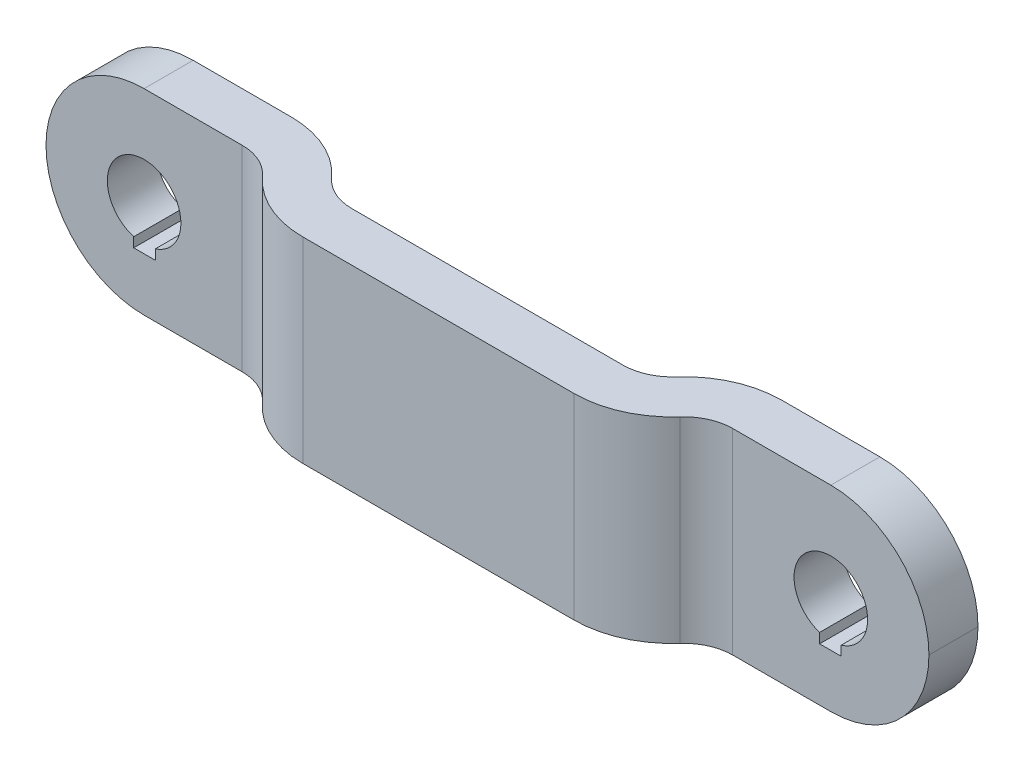
ISO-10303-21;
HEADER;
FILE_DESCRIPTION(('STEP AP214'),'2;1');
FILE_NAME('part.step','',(''),(''),'','','');
FILE_SCHEMA(('AUTOMOTIVE_DESIGN { 1 0 10303 214 1 1 1 1 }'));
ENDSEC;
DATA;
#1=APPLICATION_CONTEXT('core data for automotive mechanical design processes');
#2=APPLICATION_PROTOCOL_DEFINITION('international standard','automotive_design',2000,#1);
#3=PRODUCT_CONTEXT('',#1,'mechanical');
#4=PRODUCT('Part','Part','',(#3));
#5=PRODUCT_RELATED_PRODUCT_CATEGORY('part','',(#4));
#6=PRODUCT_DEFINITION_FORMATION('','',#4);
#7=PRODUCT_DEFINITION_CONTEXT('part definition',#1,'design');
#8=PRODUCT_DEFINITION('design','',#6,#7);
#9=PRODUCT_DEFINITION_SHAPE('','',#8);
#10=(LENGTH_UNIT() NAMED_UNIT(*) SI_UNIT(.MILLI.,.METRE.));
#11=(NAMED_UNIT(*) PLANE_ANGLE_UNIT() SI_UNIT($,.RADIAN.));
#12=(NAMED_UNIT(*) SI_UNIT($,.STERADIAN.) SOLID_ANGLE_UNIT());
#13=UNCERTAINTY_MEASURE_WITH_UNIT(LENGTH_MEASURE(1.E-05),#10,'distance_accuracy_value','');
#14=(GEOMETRIC_REPRESENTATION_CONTEXT(3) GLOBAL_UNCERTAINTY_ASSIGNED_CONTEXT((#13)) GLOBAL_UNIT_ASSIGNED_CONTEXT((#10,
#11,#12)) REPRESENTATION_CONTEXT('',''));
#15=CARTESIAN_POINT('',(0.,0.,0.));
#16=DIRECTION('',(0.,0.,1.));
#17=DIRECTION('',(1.,0.,0.));
#18=AXIS2_PLACEMENT_3D('',#15,#16,#17);
#19=CARTESIAN_POINT('',(28.575,6.35,3.175));
#20=DIRECTION('',(0.,0.,1.));
#21=DIRECTION('',(1.,0.,0.));
#22=AXIS2_PLACEMENT_3D('',#19,#20,#21);
#23=PLANE('',#22);
#24=CARTESIAN_POINT('',(22.225,0.,3.175));
#25=DIRECTION('',(0.,0.,1.));
#26=DIRECTION('',(1.,0.,0.));
#27=AXIS2_PLACEMENT_3D('',#24,#25,#26);
#28=CIRCLE('',#27,6.35);
#29=CARTESIAN_POINT('',(22.225,-6.35,3.175));
#30=VERTEX_POINT('',#29);
#31=CARTESIAN_POINT('',(28.575,0.,3.175));
#32=VERTEX_POINT('',#31);
#33=EDGE_CURVE('E378',#30,#32,#28,.T.);
#34=ORIENTED_EDGE('',*,*,#33,.T.);
#35=CARTESIAN_POINT('',(22.225,0.,3.175));
#36=DIRECTION('',(0.,0.,1.));
#37=DIRECTION('',(1.,0.,0.));
#38=AXIS2_PLACEMENT_3D('',#35,#36,#37);
#39=CIRCLE('',#38,6.35);
#40=CARTESIAN_POINT('',(22.225,6.35,3.175));
#41=VERTEX_POINT('',#40);
#42=EDGE_CURVE('E380',#32,#41,#39,.T.);
#43=ORIENTED_EDGE('',*,*,#42,.T.);
#44=DIRECTION('',(-1.,0.,0.));
#45=VECTOR('',#44,1.);
#46=CARTESIAN_POINT('',(28.575,6.35,3.175));
#47=LINE('',#46,#45);
#48=CARTESIAN_POINT('',(15.875,6.35,3.175));
#49=VERTEX_POINT('',#48);
#50=EDGE_CURVE('E328',#41,#49,#47,.T.);
#51=ORIENTED_EDGE('',*,*,#50,.T.);
#52=DIRECTION('',(0.,-1.,0.));
#53=VECTOR('',#52,1.);
#54=CARTESIAN_POINT('',(15.875,6.35,3.175));
#55=LINE('',#54,#53);
#56=CARTESIAN_POINT('',(15.875,-6.35,3.175));
#57=VERTEX_POINT('',#56);
#58=EDGE_CURVE('E362',#49,#57,#55,.T.);
#59=ORIENTED_EDGE('',*,*,#58,.T.);
#60=DIRECTION('',(-1.,0.,0.));
#61=VECTOR('',#60,1.);
#62=CARTESIAN_POINT('',(28.575,-6.35,3.175));
#63=LINE('',#62,#61);
#64=EDGE_CURVE('E294',#30,#57,#63,.T.);
#65=ORIENTED_EDGE('',*,*,#64,.F.);
#66=EDGE_LOOP('',(#34,#43,#51,#59,#65));
#67=FACE_BOUND('',#66,.T.);
#68=CARTESIAN_POINT('',(22.225,0.,3.17499999999999));
#69=DIRECTION('',(0.,0.,1.));
#70=DIRECTION('',(1.,0.,0.));
#71=AXIS2_PLACEMENT_3D('',#68,#69,#70);
#72=CIRCLE('',#71,2.38125);
#73=CARTESIAN_POINT('',(22.895630040526,-2.28486474681635,3.175));
#74=VERTEX_POINT('',#73);
#75=CARTESIAN_POINT('',(21.4986765377298,-2.26777551593095,3.17499999999999));
#76=VERTEX_POINT('',#75);
#77=EDGE_CURVE('E225',#74,#76,#72,.T.);
#78=ORIENTED_EDGE('',*,*,#77,.F.);
#79=DIRECTION('',(0.,-1.,0.));
#80=VECTOR('',#79,1.);
#81=CARTESIAN_POINT('',(22.895630040526,-2.28486474681635,3.17499999999999));
#82=LINE('',#81,#80);
#83=CARTESIAN_POINT('',(22.895630040526,-2.90885456103389,3.17499999999999));
#84=VERTEX_POINT('',#83);
#85=EDGE_CURVE('E49',#74,#84,#82,.T.);
#86=ORIENTED_EDGE('',*,*,#85,.T.);
#87=DIRECTION('',(1.,0.,0.));
#88=VECTOR('',#87,1.);
#89=CARTESIAN_POINT('',(21.4986765377298,-2.90885456103389,3.17499999999999));
#90=LINE('',#89,#88);
#91=CARTESIAN_POINT('',(21.4986765377298,-2.90885456103389,3.17499999999999));
#92=VERTEX_POINT('',#91);
#93=EDGE_CURVE('E216',#92,#84,#90,.T.);
#94=ORIENTED_EDGE('',*,*,#93,.F.);
#95=DIRECTION('',(0.,-1.,0.));
#96=VECTOR('',#95,1.);
#97=CARTESIAN_POINT('',(21.4986765377298,-2.26777551593095,3.17499999999999));
#98=LINE('',#97,#96);
#99=EDGE_CURVE('E221',#76,#92,#98,.T.);
#100=ORIENTED_EDGE('',*,*,#99,.F.);
#101=EDGE_LOOP('',(#78,#86,#94,#100));
#102=FACE_BOUND('',#101,.T.);
#103=ADVANCED_FACE('F34',(#67,#102),#23,.T.);
#104=CARTESIAN_POINT('',(28.575,6.35,0.));
#105=DIRECTION('',(0.,0.,1.));
#106=DIRECTION('',(1.,0.,0.));
#107=AXIS2_PLACEMENT_3D('',#104,#105,#106);
#108=PLANE('',#107);
#109=DIRECTION('',(-1.,0.,0.));
#110=VECTOR('',#109,1.);
#111=CARTESIAN_POINT('',(28.575,6.35,0.));
#112=LINE('',#111,#110);
#113=CARTESIAN_POINT('',(22.225,6.35,0.));
#114=VERTEX_POINT('',#113);
#115=CARTESIAN_POINT('',(15.875,6.35,0.));
#116=VERTEX_POINT('',#115);
#117=EDGE_CURVE('E330',#114,#116,#112,.T.);
#118=ORIENTED_EDGE('',*,*,#117,.F.);
#119=CARTESIAN_POINT('',(22.225,0.,0.));
#120=DIRECTION('',(0.,0.,1.));
#121=DIRECTION('',(1.,0.,0.));
#122=AXIS2_PLACEMENT_3D('',#119,#120,#121);
#123=CIRCLE('',#122,6.35);
#124=CARTESIAN_POINT('',(28.575,0.,0.));
#125=VERTEX_POINT('',#124);
#126=EDGE_CURVE('E390',#114,#125,#123,.F.);
#127=ORIENTED_EDGE('',*,*,#126,.T.);
#128=CARTESIAN_POINT('',(22.225,0.,0.));
#129=DIRECTION('',(0.,0.,1.));
#130=DIRECTION('',(1.,0.,0.));
#131=AXIS2_PLACEMENT_3D('',#128,#129,#130);
#132=CIRCLE('',#131,6.35);
#133=CARTESIAN_POINT('',(22.225,-6.35,0.));
#134=VERTEX_POINT('',#133);
#135=EDGE_CURVE('E388',#125,#134,#132,.F.);
#136=ORIENTED_EDGE('',*,*,#135,.T.);
#137=DIRECTION('',(-1.,0.,0.));
#138=VECTOR('',#137,1.);
#139=CARTESIAN_POINT('',(28.575,-6.35,0.));
#140=LINE('',#139,#138);
#141=CARTESIAN_POINT('',(15.875,-6.35,0.));
#142=VERTEX_POINT('',#141);
#143=EDGE_CURVE('E296',#134,#142,#140,.T.);
#144=ORIENTED_EDGE('',*,*,#143,.T.);
#145=DIRECTION('',(0.,-1.,0.));
#146=VECTOR('',#145,1.);
#147=CARTESIAN_POINT('',(15.875,6.35,0.));
#148=LINE('',#147,#146);
#149=EDGE_CURVE('E359',#116,#142,#148,.T.);
#150=ORIENTED_EDGE('',*,*,#149,.F.);
#151=EDGE_LOOP('',(#118,#127,#136,#144,#150));
#152=FACE_BOUND('',#151,.T.);
#153=DIRECTION('',(0.,-1.,0.));
#154=VECTOR('',#153,1.);
#155=CARTESIAN_POINT('',(22.895630040526,-2.28486474681635,0.));
#156=LINE('',#155,#154);
#157=CARTESIAN_POINT('',(22.895630040526,-2.28486474681635,0.));
#158=VERTEX_POINT('',#157);
#159=CARTESIAN_POINT('',(22.895630040526,-2.90885456103389,0.));
#160=VERTEX_POINT('',#159);
#161=EDGE_CURVE('E208',#158,#160,#156,.T.);
#162=ORIENTED_EDGE('',*,*,#161,.F.);
#163=CARTESIAN_POINT('',(22.225,0.,0.));
#164=DIRECTION('',(0.,0.,1.));
#165=DIRECTION('',(1.,0.,0.));
#166=AXIS2_PLACEMENT_3D('',#163,#164,#165);
#167=CIRCLE('',#166,2.38125);
#168=CARTESIAN_POINT('',(21.4986765377298,-2.26777551593095,0.));
#169=VERTEX_POINT('',#168);
#170=EDGE_CURVE('E234',#158,#169,#167,.T.);
#171=ORIENTED_EDGE('',*,*,#170,.T.);
#172=DIRECTION('',(0.,-1.,0.));
#173=VECTOR('',#172,1.);
#174=CARTESIAN_POINT('',(21.4986765377298,-2.26777551593095,0.));
#175=LINE('',#174,#173);
#176=CARTESIAN_POINT('',(21.4986765377298,-2.90885456103389,0.));
#177=VERTEX_POINT('',#176);
#178=EDGE_CURVE('E57',#169,#177,#175,.T.);
#179=ORIENTED_EDGE('',*,*,#178,.T.);
#180=DIRECTION('',(1.,0.,0.));
#181=VECTOR('',#180,1.);
#182=CARTESIAN_POINT('',(21.4986765377298,-2.90885456103389,0.));
#183=LINE('',#182,#181);
#184=EDGE_CURVE('E231',#177,#160,#183,.T.);
#185=ORIENTED_EDGE('',*,*,#184,.T.);
#186=EDGE_LOOP('',(#162,#171,#179,#185));
#187=FACE_BOUND('',#186,.T.);
#188=ADVANCED_FACE('F458',(#152,#187),#108,.F.);
#189=CARTESIAN_POINT('',(-28.575,6.35,3.175));
#190=DIRECTION('',(0.,0.,-1.));
#191=DIRECTION('',(-1.,0.,0.));
#192=AXIS2_PLACEMENT_3D('',#189,#190,#191);
#193=PLANE('',#192);
#194=DIRECTION('',(1.,0.,0.));
#195=VECTOR('',#194,1.);
#196=CARTESIAN_POINT('',(-28.575,6.35,3.175));
#197=LINE('',#196,#195);
#198=CARTESIAN_POINT('',(-22.225,6.35,3.175));
#199=VERTEX_POINT('',#198);
#200=CARTESIAN_POINT('',(-15.875,6.35,3.175));
#201=VERTEX_POINT('',#200);
#202=EDGE_CURVE('E314',#199,#201,#197,.T.);
#203=ORIENTED_EDGE('',*,*,#202,.F.);
#204=CARTESIAN_POINT('',(-22.225,0.,3.175));
#205=DIRECTION('',(0.,0.,-1.));
#206=DIRECTION('',(-1.,0.,0.));
#207=AXIS2_PLACEMENT_3D('',#204,#205,#206);
#208=CIRCLE('',#207,6.35);
#209=CARTESIAN_POINT('',(-28.575,0.,3.175));
#210=VERTEX_POINT('',#209);
#211=EDGE_CURVE('E398',#199,#210,#208,.F.);
#212=ORIENTED_EDGE('',*,*,#211,.T.);
#213=CARTESIAN_POINT('',(-22.225,0.,3.175));
#214=DIRECTION('',(0.,0.,-1.));
#215=DIRECTION('',(-1.,0.,0.));
#216=AXIS2_PLACEMENT_3D('',#213,#214,#215);
#217=CIRCLE('',#216,6.35);
#218=CARTESIAN_POINT('',(-22.225,-6.35,3.175));
#219=VERTEX_POINT('',#218);
#220=EDGE_CURVE('E396',#210,#219,#217,.F.);
#221=ORIENTED_EDGE('',*,*,#220,.T.);
#222=DIRECTION('',(1.,0.,0.));
#223=VECTOR('',#222,1.);
#224=CARTESIAN_POINT('',(-28.575,-6.35,3.175));
#225=LINE('',#224,#223);
#226=CARTESIAN_POINT('',(-15.875,-6.35,3.175));
#227=VERTEX_POINT('',#226);
#228=EDGE_CURVE('E279',#219,#227,#225,.T.);
#229=ORIENTED_EDGE('',*,*,#228,.T.);
#230=DIRECTION('',(0.,-1.,0.));
#231=VECTOR('',#230,1.);
#232=CARTESIAN_POINT('',(-15.875,6.35,3.175));
#233=LINE('',#232,#231);
#234=EDGE_CURVE('E375',#201,#227,#233,.T.);
#235=ORIENTED_EDGE('',*,*,#234,.F.);
#236=EDGE_LOOP('',(#203,#212,#221,#229,#235));
#237=FACE_BOUND('',#236,.T.);
#238=DIRECTION('',(0.,-1.,0.));
#239=VECTOR('',#238,1.);
#240=CARTESIAN_POINT('',(-21.4986765377298,-2.26777551593095,3.17499999999999));
#241=LINE('',#240,#239);
#242=CARTESIAN_POINT('',(-21.4986765377298,-2.26777551593095,3.17499999999999));
#243=VERTEX_POINT('',#242);
#244=CARTESIAN_POINT('',(-21.4986765377298,-2.90885456103389,3.17499999999999));
#245=VERTEX_POINT('',#244);
#246=EDGE_CURVE('E244',#243,#245,#241,.T.);
#247=ORIENTED_EDGE('',*,*,#246,.T.);
#248=DIRECTION('',(-1.,0.,0.));
#249=VECTOR('',#248,1.);
#250=CARTESIAN_POINT('',(-21.4986765377298,-2.90885456103389,3.17499999999999));
#251=LINE('',#250,#249);
#252=CARTESIAN_POINT('',(-22.895630040526,-2.90885456103389,3.17499999999999));
#253=VERTEX_POINT('',#252);
#254=EDGE_CURVE('E247',#245,#253,#251,.T.);
#255=ORIENTED_EDGE('',*,*,#254,.T.);
#256=DIRECTION('',(0.,-1.,0.));
#257=VECTOR('',#256,1.);
#258=CARTESIAN_POINT('',(-22.895630040526,-2.28486474681635,3.17499999999999));
#259=LINE('',#258,#257);
#260=CARTESIAN_POINT('',(-22.895630040526,-2.28486474681635,3.175));
#261=VERTEX_POINT('',#260);
#262=EDGE_CURVE('E250',#261,#253,#259,.T.);
#263=ORIENTED_EDGE('',*,*,#262,.F.);
#264=CARTESIAN_POINT('',(-22.225,0.,3.17499999999999));
#265=DIRECTION('',(0.,0.,-1.));
#266=DIRECTION('',(-1.,0.,0.));
#267=AXIS2_PLACEMENT_3D('',#264,#265,#266);
#268=CIRCLE('',#267,2.38125);
#269=EDGE_CURVE('E212',#261,#243,#268,.T.);
#270=ORIENTED_EDGE('',*,*,#269,.T.);
#271=EDGE_LOOP('',(#247,#255,#263,#270));
#272=FACE_BOUND('',#271,.T.);
#273=ADVANCED_FACE('F36',(#237,#272),#193,.F.);
#274=CARTESIAN_POINT('',(-28.575,6.35,0.));
#275=DIRECTION('',(0.,0.,-1.));
#276=DIRECTION('',(-1.,0.,0.));
#277=AXIS2_PLACEMENT_3D('',#274,#275,#276);
#278=PLANE('',#277);
#279=CARTESIAN_POINT('',(-22.225,0.,0.));
#280=DIRECTION('',(0.,0.,-1.));
#281=DIRECTION('',(-1.,0.,0.));
#282=AXIS2_PLACEMENT_3D('',#279,#280,#281);
#283=CIRCLE('',#282,6.35);
#284=CARTESIAN_POINT('',(-22.225,-6.35,0.));
#285=VERTEX_POINT('',#284);
#286=CARTESIAN_POINT('',(-28.575,0.,0.));
#287=VERTEX_POINT('',#286);
#288=EDGE_CURVE('E42',#285,#287,#283,.T.);
#289=ORIENTED_EDGE('',*,*,#288,.T.);
#290=CARTESIAN_POINT('',(-22.225,0.,0.));
#291=DIRECTION('',(0.,0.,-1.));
#292=DIRECTION('',(-1.,0.,0.));
#293=AXIS2_PLACEMENT_3D('',#290,#291,#292);
#294=CIRCLE('',#293,6.35);
#295=CARTESIAN_POINT('',(-22.225,6.35,0.));
#296=VERTEX_POINT('',#295);
#297=EDGE_CURVE('E11',#287,#296,#294,.T.);
#298=ORIENTED_EDGE('',*,*,#297,.T.);
#299=DIRECTION('',(1.,0.,0.));
#300=VECTOR('',#299,1.);
#301=CARTESIAN_POINT('',(-28.575,6.35,0.));
#302=LINE('',#301,#300);
#303=CARTESIAN_POINT('',(-15.875,6.35,0.));
#304=VERTEX_POINT('',#303);
#305=EDGE_CURVE('E345',#296,#304,#302,.T.);
#306=ORIENTED_EDGE('',*,*,#305,.T.);
#307=DIRECTION('',(0.,-1.,0.));
#308=VECTOR('',#307,1.);
#309=CARTESIAN_POINT('',(-15.875,6.35,0.));
#310=LINE('',#309,#308);
#311=CARTESIAN_POINT('',(-15.875,-6.35,0.));
#312=VERTEX_POINT('',#311);
#313=EDGE_CURVE('E347',#304,#312,#310,.T.);
#314=ORIENTED_EDGE('',*,*,#313,.T.);
#315=DIRECTION('',(1.,0.,0.));
#316=VECTOR('',#315,1.);
#317=CARTESIAN_POINT('',(-28.575,-6.35,0.));
#318=LINE('',#317,#316);
#319=EDGE_CURVE('E312',#285,#312,#318,.T.);
#320=ORIENTED_EDGE('',*,*,#319,.F.);
#321=EDGE_LOOP('',(#289,#298,#306,#314,#320));
#322=FACE_BOUND('',#321,.T.);
#323=DIRECTION('',(0.,-1.,0.));
#324=VECTOR('',#323,1.);
#325=CARTESIAN_POINT('',(-21.4986765377298,-2.26777551593095,0.));
#326=LINE('',#325,#324);
#327=CARTESIAN_POINT('',(-21.4986765377298,-2.26777551593095,0.));
#328=VERTEX_POINT('',#327);
#329=CARTESIAN_POINT('',(-21.4986765377298,-2.90885456103389,0.));
#330=VERTEX_POINT('',#329);
#331=EDGE_CURVE('E255',#328,#330,#326,.T.);
#332=ORIENTED_EDGE('',*,*,#331,.F.);
#333=CARTESIAN_POINT('',(-22.225,0.,0.));
#334=DIRECTION('',(0.,0.,-1.));
#335=DIRECTION('',(-1.,0.,0.));
#336=AXIS2_PLACEMENT_3D('',#333,#334,#335);
#337=CIRCLE('',#336,2.38125);
#338=CARTESIAN_POINT('',(-22.895630040526,-2.28486474681635,0.));
#339=VERTEX_POINT('',#338);
#340=EDGE_CURVE('E253',#339,#328,#337,.T.);
#341=ORIENTED_EDGE('',*,*,#340,.F.);
#342=DIRECTION('',(0.,-1.,0.));
#343=VECTOR('',#342,1.);
#344=CARTESIAN_POINT('',(-22.895630040526,-2.28486474681635,0.));
#345=LINE('',#344,#343);
#346=CARTESIAN_POINT('',(-22.895630040526,-2.90885456103389,0.));
#347=VERTEX_POINT('',#346);
#348=EDGE_CURVE('E260',#339,#347,#345,.T.);
#349=ORIENTED_EDGE('',*,*,#348,.T.);
#350=DIRECTION('',(-1.,0.,0.));
#351=VECTOR('',#350,1.);
#352=CARTESIAN_POINT('',(-21.4986765377298,-2.90885456103389,0.));
#353=LINE('',#352,#351);
#354=EDGE_CURVE('E257',#330,#347,#353,.T.);
#355=ORIENTED_EDGE('',*,*,#354,.F.);
#356=EDGE_LOOP('',(#332,#341,#349,#355));
#357=FACE_BOUND('',#356,.T.);
#358=ADVANCED_FACE('F403',(#322,#357),#278,.T.);
#359=CARTESIAN_POINT('',(-15.875,6.35,6.35));
#360=DIRECTION('',(0.,-1.,0.));
#361=DIRECTION('',(0.,0.,-1.));
#362=AXIS2_PLACEMENT_3D('',#359,#360,#361);
#363=CYLINDRICAL_SURFACE('',#362,3.175);
#364=CARTESIAN_POINT('',(-15.875,-6.35,6.35));
#365=DIRECTION('',(0.,-1.,0.));
#366=DIRECTION('',(0.,0.,-1.));
#367=AXIS2_PLACEMENT_3D('',#364,#365,#366);
#368=CIRCLE('',#367,3.175);
#369=CARTESIAN_POINT('',(-13.5084947238127,-6.35,4.23333333333333));
#370=VERTEX_POINT('',#369);
#371=EDGE_CURVE('E281',#227,#370,#368,.T.);
#372=ORIENTED_EDGE('',*,*,#371,.T.);
#373=DIRECTION('',(0.,-1.,0.));
#374=VECTOR('',#373,1.);
#375=CARTESIAN_POINT('',(-13.5084947238127,6.35,4.23333333333333));
#376=LINE('',#375,#374);
#377=CARTESIAN_POINT('',(-13.5084947238127,6.35,4.23333333333333));
#378=VERTEX_POINT('',#377);
#379=EDGE_CURVE('E372',#378,#370,#376,.T.);
#380=ORIENTED_EDGE('',*,*,#379,.F.);
#381=CARTESIAN_POINT('',(-15.875,6.35,6.35));
#382=DIRECTION('',(0.,-1.,0.));
#383=DIRECTION('',(0.,0.,-1.));
#384=AXIS2_PLACEMENT_3D('',#381,#382,#383);
#385=CIRCLE('',#384,3.175);
#386=EDGE_CURVE('E316',#201,#378,#385,.T.);
#387=ORIENTED_EDGE('',*,*,#386,.F.);
#388=ORIENTED_EDGE('',*,*,#234,.T.);
#389=EDGE_LOOP('',(#372,#380,#387,#388));
#390=FACE_BOUND('',#389,.T.);
#391=ADVANCED_FACE('F427',(#390),#363,.F.);
#392=CARTESIAN_POINT('',(-8.77548417143817,6.35,0.));
#393=DIRECTION('',(0.,-1.,0.));
#394=DIRECTION('',(0.,0.,-1.));
#395=AXIS2_PLACEMENT_3D('',#392,#393,#394);
#396=CYLINDRICAL_SURFACE('',#395,6.35);
#397=CARTESIAN_POINT('',(-8.77548417143817,-6.35,0.));
#398=DIRECTION('',(0.,1.,0.));
#399=DIRECTION('',(0.,0.,1.));
#400=AXIS2_PLACEMENT_3D('',#397,#398,#399);
#401=CIRCLE('',#400,6.35);
#402=CARTESIAN_POINT('',(-8.77548417143817,-6.35,6.35));
#403=VERTEX_POINT('',#402);
#404=EDGE_CURVE('E283',#370,#403,#401,.T.);
#405=ORIENTED_EDGE('',*,*,#404,.T.);
#406=DIRECTION('',(0.,-1.,0.));
#407=VECTOR('',#406,1.);
#408=CARTESIAN_POINT('',(-8.77548417143817,6.35,6.35));
#409=LINE('',#408,#407);
#410=CARTESIAN_POINT('',(-8.77548417143817,6.35,6.35));
#411=VERTEX_POINT('',#410);
#412=EDGE_CURVE('E369',#411,#403,#409,.T.);
#413=ORIENTED_EDGE('',*,*,#412,.F.);
#414=CARTESIAN_POINT('',(-8.77548417143817,6.35,0.));
#415=DIRECTION('',(0.,1.,0.));
#416=DIRECTION('',(0.,0.,1.));
#417=AXIS2_PLACEMENT_3D('',#414,#415,#416);
#418=CIRCLE('',#417,6.35);
#419=EDGE_CURVE('E318',#378,#411,#418,.T.);
#420=ORIENTED_EDGE('',*,*,#419,.F.);
#421=ORIENTED_EDGE('',*,*,#379,.T.);
#422=EDGE_LOOP('',(#405,#413,#420,#421));
#423=FACE_BOUND('',#422,.T.);
#424=ADVANCED_FACE('F434',(#423),#396,.T.);
#425=CARTESIAN_POINT('',(-8.77548417143817,6.35,6.35));
#426=DIRECTION('',(0.,0.,-1.));
#427=DIRECTION('',(-1.,0.,0.));
#428=AXIS2_PLACEMENT_3D('',#425,#426,#427);
#429=PLANE('',#428);
#430=DIRECTION('',(1.,0.,0.));
#431=VECTOR('',#430,1.);
#432=CARTESIAN_POINT('',(-8.77548417143817,-6.35,6.35));
#433=LINE('',#432,#431);
#434=CARTESIAN_POINT('',(8.77548417143817,-6.35,6.35));
#435=VERTEX_POINT('',#434);
#436=EDGE_CURVE('E285',#403,#435,#433,.T.);
#437=ORIENTED_EDGE('',*,*,#436,.T.);
#438=DIRECTION('',(0.,-1.,0.));
#439=VECTOR('',#438,1.);
#440=CARTESIAN_POINT('',(8.77548417143817,6.35,6.35));
#441=LINE('',#440,#439);
#442=CARTESIAN_POINT('',(8.77548417143817,6.35,6.35));
#443=VERTEX_POINT('',#442);
#444=EDGE_CURVE('E367',#443,#435,#441,.T.);
#445=ORIENTED_EDGE('',*,*,#444,.F.);
#446=DIRECTION('',(1.,0.,0.));
#447=VECTOR('',#446,1.);
#448=CARTESIAN_POINT('',(-8.77548417143817,6.35,6.35));
#449=LINE('',#448,#447);
#450=EDGE_CURVE('E320',#411,#443,#449,.T.);
#451=ORIENTED_EDGE('',*,*,#450,.F.);
#452=ORIENTED_EDGE('',*,*,#412,.T.);
#453=EDGE_LOOP('',(#437,#445,#451,#452));
#454=FACE_BOUND('',#453,.T.);
#455=ADVANCED_FACE('F438',(#454),#429,.F.);
#456=CARTESIAN_POINT('',(8.77548417143817,6.35,0.));
#457=DIRECTION('',(0.,-1.,0.));
#458=DIRECTION('',(0.,0.,-1.));
#459=AXIS2_PLACEMENT_3D('',#456,#457,#458);
#460=CYLINDRICAL_SURFACE('',#459,6.35);
#461=CARTESIAN_POINT('',(8.77548417143817,-6.35,0.));
#462=DIRECTION('',(0.,-1.,0.));
#463=DIRECTION('',(0.,0.,-1.));
#464=AXIS2_PLACEMENT_3D('',#461,#462,#463);
#465=CIRCLE('',#464,6.35);
#466=CARTESIAN_POINT('',(13.5084947238127,-6.35,4.23333333333333));
#467=VERTEX_POINT('',#466);
#468=EDGE_CURVE('E288',#467,#435,#465,.T.);
#469=ORIENTED_EDGE('',*,*,#468,.F.);
#470=DIRECTION('',(0.,-1.,0.));
#471=VECTOR('',#470,1.);
#472=CARTESIAN_POINT('',(13.5084947238127,6.35,4.23333333333333));
#473=LINE('',#472,#471);
#474=CARTESIAN_POINT('',(13.5084947238127,6.35,4.23333333333333));
#475=VERTEX_POINT('',#474);
#476=EDGE_CURVE('E365',#475,#467,#473,.T.);
#477=ORIENTED_EDGE('',*,*,#476,.F.);
#478=CARTESIAN_POINT('',(8.77548417143817,6.35,0.));
#479=DIRECTION('',(0.,-1.,0.));
#480=DIRECTION('',(0.,0.,-1.));
#481=AXIS2_PLACEMENT_3D('',#478,#479,#480);
#482=CIRCLE('',#481,6.35);
#483=EDGE_CURVE('E322',#475,#443,#482,.T.);
#484=ORIENTED_EDGE('',*,*,#483,.T.);
#485=ORIENTED_EDGE('',*,*,#444,.T.);
#486=EDGE_LOOP('',(#469,#477,#484,#485));
#487=FACE_BOUND('',#486,.T.);
#488=ADVANCED_FACE('F441',(#487),#460,.T.);
#489=CARTESIAN_POINT('',(15.875,6.35,6.35));
#490=DIRECTION('',(0.,-1.,0.));
#491=DIRECTION('',(0.,0.,-1.));
#492=AXIS2_PLACEMENT_3D('',#489,#490,#491);
#493=CYLINDRICAL_SURFACE('',#492,3.175);
#494=CARTESIAN_POINT('',(15.875,-6.35,6.35));
#495=DIRECTION('',(0.,1.,0.));
#496=DIRECTION('',(0.,0.,1.));
#497=AXIS2_PLACEMENT_3D('',#494,#495,#496);
#498=CIRCLE('',#497,3.175);
#499=EDGE_CURVE('E291',#57,#467,#498,.T.);
#500=ORIENTED_EDGE('',*,*,#499,.F.);
#501=ORIENTED_EDGE('',*,*,#58,.F.);
#502=CARTESIAN_POINT('',(15.875,6.35,6.35));
#503=DIRECTION('',(0.,1.,0.));
#504=DIRECTION('',(0.,0.,1.));
#505=AXIS2_PLACEMENT_3D('',#502,#503,#504);
#506=CIRCLE('',#505,3.175);
#507=EDGE_CURVE('E325',#49,#475,#506,.T.);
#508=ORIENTED_EDGE('',*,*,#507,.T.);
#509=ORIENTED_EDGE('',*,*,#476,.T.);
#510=EDGE_LOOP('',(#500,#501,#508,#509));
#511=FACE_BOUND('',#510,.T.);
#512=ADVANCED_FACE('F446',(#511),#493,.F.);
#513=CARTESIAN_POINT('',(15.875,6.35,6.35));
#514=DIRECTION('',(0.,-1.,0.));
#515=DIRECTION('',(0.,0.,-1.));
#516=AXIS2_PLACEMENT_3D('',#513,#514,#515);
#517=CYLINDRICAL_SURFACE('',#516,6.35);
#518=CARTESIAN_POINT('',(15.875,-6.35,6.35));
#519=DIRECTION('',(0.,1.,0.));
#520=DIRECTION('',(0.,0.,1.));
#521=AXIS2_PLACEMENT_3D('',#518,#519,#520);
#522=CIRCLE('',#521,6.35);
#523=CARTESIAN_POINT('',(11.1419894476254,-6.35,2.11666666666666));
#524=VERTEX_POINT('',#523);
#525=EDGE_CURVE('E298',#142,#524,#522,.T.);
#526=ORIENTED_EDGE('',*,*,#525,.T.);
#527=DIRECTION('',(0.,-1.,0.));
#528=VECTOR('',#527,1.);
#529=CARTESIAN_POINT('',(11.1419894476254,6.35,2.11666666666666));
#530=LINE('',#529,#528);
#531=CARTESIAN_POINT('',(11.1419894476254,6.35,2.11666666666666));
#532=VERTEX_POINT('',#531);
#533=EDGE_CURVE('E356',#532,#524,#530,.T.);
#534=ORIENTED_EDGE('',*,*,#533,.F.);
#535=CARTESIAN_POINT('',(15.875,6.35,6.35));
#536=DIRECTION('',(0.,1.,0.));
#537=DIRECTION('',(0.,0.,1.));
#538=AXIS2_PLACEMENT_3D('',#535,#536,#537);
#539=CIRCLE('',#538,6.35);
#540=EDGE_CURVE('E332',#116,#532,#539,.T.);
#541=ORIENTED_EDGE('',*,*,#540,.F.);
#542=ORIENTED_EDGE('',*,*,#149,.T.);
#543=EDGE_LOOP('',(#526,#534,#541,#542));
#544=FACE_BOUND('',#543,.T.);
#545=ADVANCED_FACE('F471',(#544),#517,.T.);
#546=CARTESIAN_POINT('',(8.77548417143817,6.35,0.));
#547=DIRECTION('',(0.,-1.,0.));
#548=DIRECTION('',(0.,0.,-1.));
#549=AXIS2_PLACEMENT_3D('',#546,#547,#548);
#550=CYLINDRICAL_SURFACE('',#549,3.175);
#551=CARTESIAN_POINT('',(8.77548417143817,-6.35,0.));
#552=DIRECTION('',(0.,-1.,0.));
#553=DIRECTION('',(0.,0.,-1.));
#554=AXIS2_PLACEMENT_3D('',#551,#552,#553);
#555=CIRCLE('',#554,3.175);
#556=CARTESIAN_POINT('',(8.77548417143817,-6.35,3.175));
#557=VERTEX_POINT('',#556);
#558=EDGE_CURVE('E300',#524,#557,#555,.T.);
#559=ORIENTED_EDGE('',*,*,#558,.T.);
#560=DIRECTION('',(0.,-1.,0.));
#561=VECTOR('',#560,1.);
#562=CARTESIAN_POINT('',(8.77548417143817,6.35,3.175));
#563=LINE('',#562,#561);
#564=CARTESIAN_POINT('',(8.77548417143817,6.35,3.175));
#565=VERTEX_POINT('',#564);
#566=EDGE_CURVE('E354',#565,#557,#563,.T.);
#567=ORIENTED_EDGE('',*,*,#566,.F.);
#568=CARTESIAN_POINT('',(8.77548417143817,6.35,0.));
#569=DIRECTION('',(0.,-1.,0.));
#570=DIRECTION('',(0.,0.,-1.));
#571=AXIS2_PLACEMENT_3D('',#568,#569,#570);
#572=CIRCLE('',#571,3.175);
#573=EDGE_CURVE('E334',#532,#565,#572,.T.);
#574=ORIENTED_EDGE('',*,*,#573,.F.);
#575=ORIENTED_EDGE('',*,*,#533,.T.);
#576=EDGE_LOOP('',(#559,#567,#574,#575));
#577=FACE_BOUND('',#576,.T.);
#578=ADVANCED_FACE('F478',(#577),#550,.F.);
#579=CARTESIAN_POINT('',(-8.77548417143817,6.35,3.175));
#580=DIRECTION('',(0.,0.,-1.));
#581=DIRECTION('',(-1.,0.,0.));
#582=AXIS2_PLACEMENT_3D('',#579,#580,#581);
#583=PLANE('',#582);
#584=DIRECTION('',(1.,0.,0.));
#585=VECTOR('',#584,1.);
#586=CARTESIAN_POINT('',(-8.77548417143817,-6.35,3.175));
#587=LINE('',#586,#585);
#588=CARTESIAN_POINT('',(-8.77548417143817,-6.35,3.175));
#589=VERTEX_POINT('',#588);
#590=EDGE_CURVE('E303',#589,#557,#587,.T.);
#591=ORIENTED_EDGE('',*,*,#590,.F.);
#592=DIRECTION('',(0.,-1.,0.));
#593=VECTOR('',#592,1.);
#594=CARTESIAN_POINT('',(-8.77548417143817,6.35,3.175));
#595=LINE('',#594,#593);
#596=CARTESIAN_POINT('',(-8.77548417143817,6.35,3.175));
#597=VERTEX_POINT('',#596);
#598=EDGE_CURVE('E352',#597,#589,#595,.T.);
#599=ORIENTED_EDGE('',*,*,#598,.F.);
#600=DIRECTION('',(1.,0.,0.));
#601=VECTOR('',#600,1.);
#602=CARTESIAN_POINT('',(-8.77548417143817,6.35,3.175));
#603=LINE('',#602,#601);
#604=EDGE_CURVE('E336',#597,#565,#603,.T.);
#605=ORIENTED_EDGE('',*,*,#604,.T.);
#606=ORIENTED_EDGE('',*,*,#566,.T.);
#607=EDGE_LOOP('',(#591,#599,#605,#606));
#608=FACE_BOUND('',#607,.T.);
#609=ADVANCED_FACE('F481',(#608),#583,.T.);
#610=CARTESIAN_POINT('',(-8.77548417143817,6.35,0.));
#611=DIRECTION('',(0.,-1.,0.));
#612=DIRECTION('',(0.,0.,-1.));
#613=AXIS2_PLACEMENT_3D('',#610,#611,#612);
#614=CYLINDRICAL_SURFACE('',#613,3.175);
#615=CARTESIAN_POINT('',(-8.77548417143817,-6.35,0.));
#616=DIRECTION('',(0.,1.,0.));
#617=DIRECTION('',(0.,0.,1.));
#618=AXIS2_PLACEMENT_3D('',#615,#616,#617);
#619=CIRCLE('',#618,3.175);
#620=CARTESIAN_POINT('',(-11.1419894476254,-6.35,2.11666666666666));
#621=VERTEX_POINT('',#620);
#622=EDGE_CURVE('E306',#621,#589,#619,.T.);
#623=ORIENTED_EDGE('',*,*,#622,.F.);
#624=DIRECTION('',(0.,-1.,0.));
#625=VECTOR('',#624,1.);
#626=CARTESIAN_POINT('',(-11.1419894476254,6.35,2.11666666666666));
#627=LINE('',#626,#625);
#628=CARTESIAN_POINT('',(-11.1419894476254,6.35,2.11666666666666));
#629=VERTEX_POINT('',#628);
#630=EDGE_CURVE('E350',#629,#621,#627,.T.);
#631=ORIENTED_EDGE('',*,*,#630,.F.);
#632=CARTESIAN_POINT('',(-8.77548417143817,6.35,0.));
#633=DIRECTION('',(0.,1.,0.));
#634=DIRECTION('',(0.,0.,1.));
#635=AXIS2_PLACEMENT_3D('',#632,#633,#634);
#636=CIRCLE('',#635,3.175);
#637=EDGE_CURVE('E339',#629,#597,#636,.T.);
#638=ORIENTED_EDGE('',*,*,#637,.T.);
#639=ORIENTED_EDGE('',*,*,#598,.T.);
#640=EDGE_LOOP('',(#623,#631,#638,#639));
#641=FACE_BOUND('',#640,.T.);
#642=ADVANCED_FACE('F484',(#641),#614,.F.);
#643=CARTESIAN_POINT('',(-15.875,6.35,6.35));
#644=DIRECTION('',(0.,-1.,0.));
#645=DIRECTION('',(0.,0.,-1.));
#646=AXIS2_PLACEMENT_3D('',#643,#644,#645);
#647=CYLINDRICAL_SURFACE('',#646,6.35);
#648=CARTESIAN_POINT('',(-15.875,-6.35,6.35));
#649=DIRECTION('',(0.,-1.,0.));
#650=DIRECTION('',(0.,0.,-1.));
#651=AXIS2_PLACEMENT_3D('',#648,#649,#650);
#652=CIRCLE('',#651,6.35);
#653=EDGE_CURVE('E309',#312,#621,#652,.T.);
#654=ORIENTED_EDGE('',*,*,#653,.F.);
#655=ORIENTED_EDGE('',*,*,#313,.F.);
#656=CARTESIAN_POINT('',(-15.875,6.35,6.35));
#657=DIRECTION('',(0.,-1.,0.));
#658=DIRECTION('',(0.,0.,-1.));
#659=AXIS2_PLACEMENT_3D('',#656,#657,#658);
#660=CIRCLE('',#659,6.35);
#661=EDGE_CURVE('E342',#304,#629,#660,.T.);
#662=ORIENTED_EDGE('',*,*,#661,.T.);
#663=ORIENTED_EDGE('',*,*,#630,.T.);
#664=EDGE_LOOP('',(#654,#655,#662,#663));
#665=FACE_BOUND('',#664,.T.);
#666=ADVANCED_FACE('F488',(#665),#647,.T.);
#667=CARTESIAN_POINT('',(-15.875,6.35,6.35));
#668=DIRECTION('',(0.,-1.,0.));
#669=DIRECTION('',(0.,0.,-1.));
#670=AXIS2_PLACEMENT_3D('',#667,#668,#669);
#671=PLANE('',#670);
#672=ORIENTED_EDGE('',*,*,#50,.F.);
#673=DIRECTION('',(0.,0.,1.));
#674=VECTOR('',#673,1.);
#675=CARTESIAN_POINT('',(22.225,6.35,0.));
#676=LINE('',#675,#674);
#677=EDGE_CURVE('E385',#41,#114,#676,.F.);
#678=ORIENTED_EDGE('',*,*,#677,.T.);
#679=ORIENTED_EDGE('',*,*,#117,.T.);
#680=ORIENTED_EDGE('',*,*,#540,.T.);
#681=ORIENTED_EDGE('',*,*,#573,.T.);
#682=ORIENTED_EDGE('',*,*,#604,.F.);
#683=ORIENTED_EDGE('',*,*,#637,.F.);
#684=ORIENTED_EDGE('',*,*,#661,.F.);
#685=ORIENTED_EDGE('',*,*,#305,.F.);
#686=DIRECTION('',(0.,0.,1.));
#687=VECTOR('',#686,1.);
#688=CARTESIAN_POINT('',(-22.225,6.35,6.34999999999999));
#689=LINE('',#688,#687);
#690=EDGE_CURVE('E382',#296,#199,#689,.T.);
#691=ORIENTED_EDGE('',*,*,#690,.T.);
#692=ORIENTED_EDGE('',*,*,#202,.T.);
#693=ORIENTED_EDGE('',*,*,#386,.T.);
#694=ORIENTED_EDGE('',*,*,#419,.T.);
#695=ORIENTED_EDGE('',*,*,#450,.T.);
#696=ORIENTED_EDGE('',*,*,#483,.F.);
#697=ORIENTED_EDGE('',*,*,#507,.F.);
#698=EDGE_LOOP('',(#672,#678,#679,#680,#681,#682,#683,#684,#685,#691,#692,#693,#694,#695,#696,#697));
#699=FACE_BOUND('',#698,.T.);
#700=ADVANCED_FACE('F417',(#699),#671,.F.);
#701=CARTESIAN_POINT('',(-15.875,-6.35,6.35));
#702=DIRECTION('',(0.,-1.,0.));
#703=DIRECTION('',(0.,0.,-1.));
#704=AXIS2_PLACEMENT_3D('',#701,#702,#703);
#705=PLANE('',#704);
#706=ORIENTED_EDGE('',*,*,#143,.F.);
#707=DIRECTION('',(0.,0.,1.));
#708=VECTOR('',#707,1.);
#709=CARTESIAN_POINT('',(22.225,-6.35,6.34999999999996));
#710=LINE('',#709,#708);
#711=EDGE_CURVE('E394',#134,#30,#710,.T.);
#712=ORIENTED_EDGE('',*,*,#711,.T.);
#713=ORIENTED_EDGE('',*,*,#64,.T.);
#714=ORIENTED_EDGE('',*,*,#499,.T.);
#715=ORIENTED_EDGE('',*,*,#468,.T.);
#716=ORIENTED_EDGE('',*,*,#436,.F.);
#717=ORIENTED_EDGE('',*,*,#404,.F.);
#718=ORIENTED_EDGE('',*,*,#371,.F.);
#719=ORIENTED_EDGE('',*,*,#228,.F.);
#720=DIRECTION('',(0.,0.,1.));
#721=VECTOR('',#720,1.);
#722=CARTESIAN_POINT('',(-22.225,-6.35,0.));
#723=LINE('',#722,#721);
#724=EDGE_CURVE('E392',#219,#285,#723,.F.);
#725=ORIENTED_EDGE('',*,*,#724,.T.);
#726=ORIENTED_EDGE('',*,*,#319,.T.);
#727=ORIENTED_EDGE('',*,*,#653,.T.);
#728=ORIENTED_EDGE('',*,*,#622,.T.);
#729=ORIENTED_EDGE('',*,*,#590,.T.);
#730=ORIENTED_EDGE('',*,*,#558,.F.);
#731=ORIENTED_EDGE('',*,*,#525,.F.);
#732=EDGE_LOOP('',(#706,#712,#713,#714,#715,#716,#717,#718,#719,#725,#726,#727,#728,#729,#730,#731));
#733=FACE_BOUND('',#732,.T.);
#734=ADVANCED_FACE('F466',(#733),#705,.T.);
#735=CARTESIAN_POINT('',(22.225,0.,6.34999999999996));
#736=DIRECTION('',(0.,0.,1.));
#737=DIRECTION('',(1.,0.,0.));
#738=AXIS2_PLACEMENT_3D('',#735,#736,#737);
#739=CYLINDRICAL_SURFACE('',#738,6.35);
#740=ORIENTED_EDGE('',*,*,#711,.F.);
#741=ORIENTED_EDGE('',*,*,#135,.F.);
#742=DIRECTION('',(0.,0.,1.));
#743=VECTOR('',#742,1.);
#744=CARTESIAN_POINT('',(28.575,0.,0.));
#745=LINE('',#744,#743);
#746=EDGE_CURVE('E276',#32,#125,#745,.F.);
#747=ORIENTED_EDGE('',*,*,#746,.F.);
#748=ORIENTED_EDGE('',*,*,#33,.F.);
#749=EDGE_LOOP('',(#740,#741,#747,#748));
#750=FACE_BOUND('',#749,.T.);
#751=ADVANCED_FACE('F464',(#750),#739,.T.);
#752=CARTESIAN_POINT('',(22.225,0.,0.));
#753=DIRECTION('',(0.,0.,-1.));
#754=DIRECTION('',(-1.,0.,0.));
#755=AXIS2_PLACEMENT_3D('',#752,#753,#754);
#756=CYLINDRICAL_SURFACE('',#755,6.35);
#757=ORIENTED_EDGE('',*,*,#126,.F.);
#758=ORIENTED_EDGE('',*,*,#677,.F.);
#759=ORIENTED_EDGE('',*,*,#42,.F.);
#760=ORIENTED_EDGE('',*,*,#746,.T.);
#761=EDGE_LOOP('',(#757,#758,#759,#760));
#762=FACE_BOUND('',#761,.T.);
#763=ADVANCED_FACE('F454',(#762),#756,.T.);
#764=CARTESIAN_POINT('',(-22.225,0.,0.));
#765=DIRECTION('',(0.,0.,-1.));
#766=DIRECTION('',(-1.,0.,0.));
#767=AXIS2_PLACEMENT_3D('',#764,#765,#766);
#768=CYLINDRICAL_SURFACE('',#767,6.35);
#769=DIRECTION('',(0.,0.,1.));
#770=VECTOR('',#769,1.);
#771=CARTESIAN_POINT('',(-28.575,0.,3.175));
#772=LINE('',#771,#770);
#773=EDGE_CURVE('E273',#287,#210,#772,.T.);
#774=ORIENTED_EDGE('',*,*,#773,.F.);
#775=ORIENTED_EDGE('',*,*,#288,.F.);
#776=ORIENTED_EDGE('',*,*,#724,.F.);
#777=ORIENTED_EDGE('',*,*,#220,.F.);
#778=EDGE_LOOP('',(#774,#775,#776,#777));
#779=FACE_BOUND('',#778,.T.);
#780=ADVANCED_FACE('F410',(#779),#768,.T.);
#781=CARTESIAN_POINT('',(-22.225,0.,6.34999999999999));
#782=DIRECTION('',(0.,0.,1.));
#783=DIRECTION('',(1.,0.,0.));
#784=AXIS2_PLACEMENT_3D('',#781,#782,#783);
#785=CYLINDRICAL_SURFACE('',#784,6.35);
#786=ORIENTED_EDGE('',*,*,#297,.F.);
#787=ORIENTED_EDGE('',*,*,#773,.T.);
#788=ORIENTED_EDGE('',*,*,#211,.F.);
#789=ORIENTED_EDGE('',*,*,#690,.F.);
#790=EDGE_LOOP('',(#786,#787,#788,#789));
#791=FACE_BOUND('',#790,.T.);
#792=ADVANCED_FACE('F413',(#791),#785,.T.);
#793=CARTESIAN_POINT('',(-22.225,0.,0.));
#794=DIRECTION('',(0.,0.,1.));
#795=DIRECTION('',(1.,0.,0.));
#796=AXIS2_PLACEMENT_3D('',#793,#794,#795);
#797=CYLINDRICAL_SURFACE('',#796,2.38125);
#798=ORIENTED_EDGE('',*,*,#269,.F.);
#799=DIRECTION('',(0.,0.,1.));
#800=VECTOR('',#799,1.);
#801=CARTESIAN_POINT('',(-22.895630040526,-2.28486474681635,0.));
#802=LINE('',#801,#800);
#803=EDGE_CURVE('E263',#339,#261,#802,.T.);
#804=ORIENTED_EDGE('',*,*,#803,.F.);
#805=ORIENTED_EDGE('',*,*,#340,.T.);
#806=DIRECTION('',(0.,0.,1.));
#807=VECTOR('',#806,1.);
#808=CARTESIAN_POINT('',(-21.4986765377298,-2.26777551593095,0.));
#809=LINE('',#808,#807);
#810=EDGE_CURVE('E270',#328,#243,#809,.T.);
#811=ORIENTED_EDGE('',*,*,#810,.T.);
#812=EDGE_LOOP('',(#798,#804,#805,#811));
#813=FACE_BOUND('',#812,.T.);
#814=ADVANCED_FACE('F531',(#813),#797,.F.);
#815=CARTESIAN_POINT('',(-21.4986765377298,-2.26777551593095,0.));
#816=DIRECTION('',(-1.,0.,0.));
#817=DIRECTION('',(0.,0.,1.));
#818=AXIS2_PLACEMENT_3D('',#815,#816,#817);
#819=PLANE('',#818);
#820=ORIENTED_EDGE('',*,*,#246,.F.);
#821=ORIENTED_EDGE('',*,*,#810,.F.);
#822=ORIENTED_EDGE('',*,*,#331,.T.);
#823=DIRECTION('',(0.,0.,1.));
#824=VECTOR('',#823,1.);
#825=CARTESIAN_POINT('',(-21.4986765377298,-2.90885456103389,0.));
#826=LINE('',#825,#824);
#827=EDGE_CURVE('E268',#330,#245,#826,.T.);
#828=ORIENTED_EDGE('',*,*,#827,.T.);
#829=EDGE_LOOP('',(#820,#821,#822,#828));
#830=FACE_BOUND('',#829,.T.);
#831=ADVANCED_FACE('F534',(#830),#819,.T.);
#832=CARTESIAN_POINT('',(-21.4986765377298,-2.90885456103389,0.));
#833=DIRECTION('',(0.,1.,0.));
#834=DIRECTION('',(0.,0.,1.));
#835=AXIS2_PLACEMENT_3D('',#832,#833,#834);
#836=PLANE('',#835);
#837=ORIENTED_EDGE('',*,*,#254,.F.);
#838=ORIENTED_EDGE('',*,*,#827,.F.);
#839=ORIENTED_EDGE('',*,*,#354,.T.);
#840=DIRECTION('',(0.,0.,1.));
#841=VECTOR('',#840,1.);
#842=CARTESIAN_POINT('',(-22.895630040526,-2.90885456103389,0.));
#843=LINE('',#842,#841);
#844=EDGE_CURVE('E266',#347,#253,#843,.T.);
#845=ORIENTED_EDGE('',*,*,#844,.T.);
#846=EDGE_LOOP('',(#837,#838,#839,#845));
#847=FACE_BOUND('',#846,.T.);
#848=ADVANCED_FACE('F538',(#847),#836,.T.);
#849=CARTESIAN_POINT('',(-22.895630040526,-2.28486474681635,0.));
#850=DIRECTION('',(-1.,0.,0.));
#851=DIRECTION('',(0.,0.,1.));
#852=AXIS2_PLACEMENT_3D('',#849,#850,#851);
#853=PLANE('',#852);
#854=ORIENTED_EDGE('',*,*,#262,.T.);
#855=ORIENTED_EDGE('',*,*,#844,.F.);
#856=ORIENTED_EDGE('',*,*,#348,.F.);
#857=ORIENTED_EDGE('',*,*,#803,.T.);
#858=EDGE_LOOP('',(#854,#855,#856,#857));
#859=FACE_BOUND('',#858,.T.);
#860=ADVANCED_FACE('F542',(#859),#853,.F.);
#861=CARTESIAN_POINT('',(22.895630040526,-2.28486474681635,0.));
#862=DIRECTION('',(-1.,0.,0.));
#863=DIRECTION('',(0.,0.,1.));
#864=AXIS2_PLACEMENT_3D('',#861,#862,#863);
#865=PLANE('',#864);
#866=ORIENTED_EDGE('',*,*,#85,.F.);
#867=DIRECTION('',(0.,0.,1.));
#868=VECTOR('',#867,1.);
#869=CARTESIAN_POINT('',(22.895630040526,-2.28486474681635,0.));
#870=LINE('',#869,#868);
#871=EDGE_CURVE('E237',#158,#74,#870,.T.);
#872=ORIENTED_EDGE('',*,*,#871,.F.);
#873=ORIENTED_EDGE('',*,*,#161,.T.);
#874=DIRECTION('',(0.,0.,1.));
#875=VECTOR('',#874,1.);
#876=CARTESIAN_POINT('',(22.895630040526,-2.90885456103389,0.));
#877=LINE('',#876,#875);
#878=EDGE_CURVE('E204',#160,#84,#877,.T.);
#879=ORIENTED_EDGE('',*,*,#878,.T.);
#880=EDGE_LOOP('',(#866,#872,#873,#879));
#881=FACE_BOUND('',#880,.T.);
#882=ADVANCED_FACE('F206',(#881),#865,.T.);
#883=CARTESIAN_POINT('',(21.4986765377298,-2.90885456103389,0.));
#884=DIRECTION('',(0.,-1.,0.));
#885=DIRECTION('',(0.,0.,-1.));
#886=AXIS2_PLACEMENT_3D('',#883,#884,#885);
#887=PLANE('',#886);
#888=ORIENTED_EDGE('',*,*,#93,.T.);
#889=ORIENTED_EDGE('',*,*,#878,.F.);
#890=ORIENTED_EDGE('',*,*,#184,.F.);
#891=DIRECTION('',(0.,0.,1.));
#892=VECTOR('',#891,1.);
#893=CARTESIAN_POINT('',(21.4986765377298,-2.90885456103389,0.));
#894=LINE('',#893,#892);
#895=EDGE_CURVE('E213',#177,#92,#894,.T.);
#896=ORIENTED_EDGE('',*,*,#895,.T.);
#897=EDGE_LOOP('',(#888,#889,#890,#896));
#898=FACE_BOUND('',#897,.T.);
#899=ADVANCED_FACE('F217',(#898),#887,.F.);
#900=CARTESIAN_POINT('',(21.4986765377298,-2.26777551593095,0.));
#901=DIRECTION('',(-1.,0.,0.));
#902=DIRECTION('',(0.,0.,1.));
#903=AXIS2_PLACEMENT_3D('',#900,#901,#902);
#904=PLANE('',#903);
#905=ORIENTED_EDGE('',*,*,#99,.T.);
#906=ORIENTED_EDGE('',*,*,#895,.F.);
#907=ORIENTED_EDGE('',*,*,#178,.F.);
#908=DIRECTION('',(0.,0.,1.));
#909=VECTOR('',#908,1.);
#910=CARTESIAN_POINT('',(21.4986765377298,-2.26777551593095,0.));
#911=LINE('',#910,#909);
#912=EDGE_CURVE('E239',#169,#76,#911,.T.);
#913=ORIENTED_EDGE('',*,*,#912,.T.);
#914=EDGE_LOOP('',(#905,#906,#907,#913));
#915=FACE_BOUND('',#914,.T.);
#916=ADVANCED_FACE('F551',(#915),#904,.F.);
#917=CARTESIAN_POINT('',(22.225,0.,0.));
#918=DIRECTION('',(0.,0.,1.));
#919=DIRECTION('',(1.,0.,0.));
#920=AXIS2_PLACEMENT_3D('',#917,#918,#919);
#921=CYLINDRICAL_SURFACE('',#920,2.38125);
#922=ORIENTED_EDGE('',*,*,#77,.T.);
#923=ORIENTED_EDGE('',*,*,#912,.F.);
#924=ORIENTED_EDGE('',*,*,#170,.F.);
#925=ORIENTED_EDGE('',*,*,#871,.T.);
#926=EDGE_LOOP('',(#922,#923,#924,#925));
#927=FACE_BOUND('',#926,.T.);
#928=ADVANCED_FACE('F554',(#927),#921,.F.);
#929=CLOSED_SHELL('',(#103,#188,#273,#358,#391,#424,#455,#488,#512,#545,#578,#609,#642,#666,
#700,#734,#751,#763,#780,#792,#814,#831,#848,#860,#882,#899,#916,#928));
#930=MANIFOLD_SOLID_BREP('B2',#929);
#931=ADVANCED_BREP_SHAPE_REPRESENTATION('',(#18,#930),#14);
#932=SHAPE_DEFINITION_REPRESENTATION(#9,#931);
ENDSEC;
END-ISO-10303-21;
